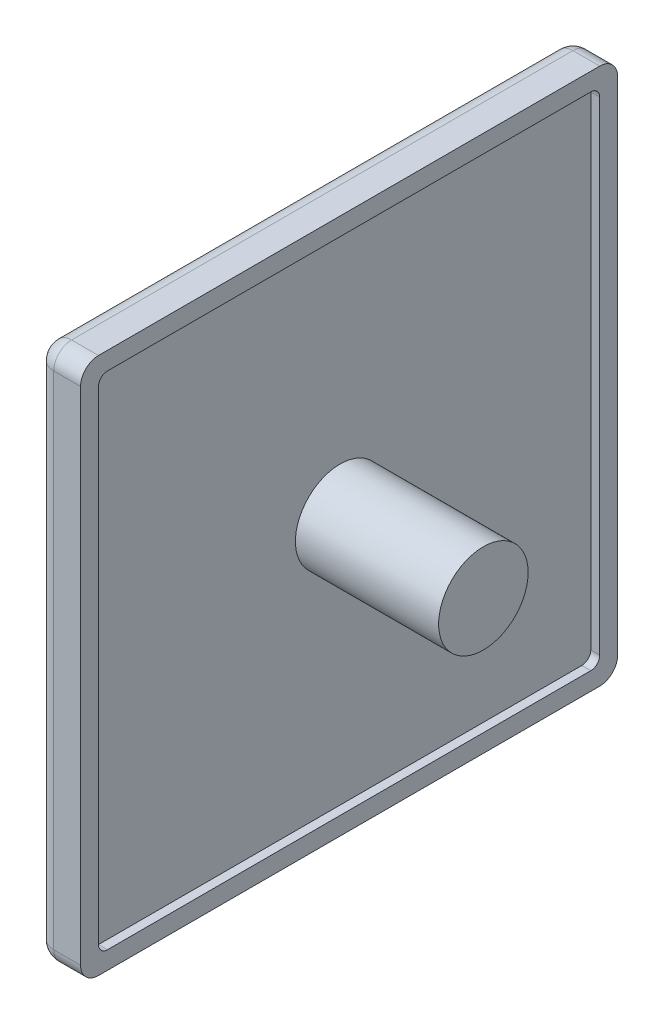
ISO-10303-21;
HEADER;
FILE_DESCRIPTION(('STEP AP214'),'2;1');
FILE_NAME('part.step','',(''),(''),'','','');
FILE_SCHEMA(('AUTOMOTIVE_DESIGN { 1 0 10303 214 1 1 1 1 }'));
ENDSEC;
DATA;
#1=APPLICATION_CONTEXT('core data for automotive mechanical design processes');
#2=APPLICATION_PROTOCOL_DEFINITION('international standard','automotive_design',2000,#1);
#3=PRODUCT_CONTEXT('',#1,'mechanical');
#4=PRODUCT('Part','Part','',(#3));
#5=PRODUCT_RELATED_PRODUCT_CATEGORY('part','',(#4));
#6=PRODUCT_DEFINITION_FORMATION('','',#4);
#7=PRODUCT_DEFINITION_CONTEXT('part definition',#1,'design');
#8=PRODUCT_DEFINITION('design','',#6,#7);
#9=PRODUCT_DEFINITION_SHAPE('','',#8);
#10=(LENGTH_UNIT() NAMED_UNIT(*) SI_UNIT(.MILLI.,.METRE.));
#11=(NAMED_UNIT(*) PLANE_ANGLE_UNIT() SI_UNIT($,.RADIAN.));
#12=(NAMED_UNIT(*) SI_UNIT($,.STERADIAN.) SOLID_ANGLE_UNIT());
#13=UNCERTAINTY_MEASURE_WITH_UNIT(LENGTH_MEASURE(1.E-05),#10,'distance_accuracy_value','');
#14=(GEOMETRIC_REPRESENTATION_CONTEXT(3) GLOBAL_UNCERTAINTY_ASSIGNED_CONTEXT((#13)) GLOBAL_UNIT_ASSIGNED_CONTEXT((#10,
#11,#12)) REPRESENTATION_CONTEXT('',''));
#15=CARTESIAN_POINT('',(0.,0.,0.));
#16=DIRECTION('',(0.,0.,1.));
#17=DIRECTION('',(1.,0.,0.));
#18=AXIS2_PLACEMENT_3D('',#15,#16,#17);
#19=CARTESIAN_POINT('',(2.5,0.,0.));
#20=DIRECTION('',(0.,0.,-1.));
#21=DIRECTION('',(-1.,0.,0.));
#22=AXIS2_PLACEMENT_3D('',#19,#20,#21);
#23=PLANE('',#22);
#24=DIRECTION('',(0.,-1.,0.));
#25=VECTOR('',#24,1.);
#26=CARTESIAN_POINT('',(2.5,0.,0.));
#27=LINE('',#26,#25);
#28=CARTESIAN_POINT('',(2.5,29.,0.));
#29=VERTEX_POINT('',#28);
#30=CARTESIAN_POINT('',(2.5,1.,0.));
#31=VERTEX_POINT('',#30);
#32=EDGE_CURVE('E325',#29,#31,#27,.T.);
#33=ORIENTED_EDGE('',*,*,#32,.F.);
#34=DIRECTION('',(-1.,0.,0.));
#35=VECTOR('',#34,1.);
#36=CARTESIAN_POINT('',(2.5,29.,0.));
#37=LINE('',#36,#35);
#38=CARTESIAN_POINT('',(1.,29.,0.));
#39=VERTEX_POINT('',#38);
#40=EDGE_CURVE('E227',#29,#39,#37,.T.);
#41=ORIENTED_EDGE('',*,*,#40,.T.);
#42=DIRECTION('',(0.,-1.,0.));
#43=VECTOR('',#42,1.);
#44=CARTESIAN_POINT('',(1.,0.,0.));
#45=LINE('',#44,#43);
#46=CARTESIAN_POINT('',(1.,1.,0.));
#47=VERTEX_POINT('',#46);
#48=EDGE_CURVE('E175',#39,#47,#45,.T.);
#49=ORIENTED_EDGE('',*,*,#48,.T.);
#50=DIRECTION('',(-1.,0.,0.));
#51=VECTOR('',#50,1.);
#52=CARTESIAN_POINT('',(2.5,1.,0.));
#53=LINE('',#52,#51);
#54=EDGE_CURVE('E225',#47,#31,#53,.F.);
#55=ORIENTED_EDGE('',*,*,#54,.T.);
#56=EDGE_LOOP('',(#33,#41,#49,#55));
#57=FACE_BOUND('',#56,.T.);
#58=ADVANCED_FACE('F40',(#57),#23,.F.);
#59=CARTESIAN_POINT('',(2.5,0.,0.));
#60=DIRECTION('',(0.,1.,0.));
#61=DIRECTION('',(0.,0.,1.));
#62=AXIS2_PLACEMENT_3D('',#59,#60,#61);
#63=PLANE('',#62);
#64=DIRECTION('',(0.,0.,-1.));
#65=VECTOR('',#64,1.);
#66=CARTESIAN_POINT('',(1.,0.,-30.));
#67=LINE('',#66,#65);
#68=CARTESIAN_POINT('',(1.,0.,-1.));
#69=VERTEX_POINT('',#68);
#70=CARTESIAN_POINT('',(1.,0.,-29.));
#71=VERTEX_POINT('',#70);
#72=EDGE_CURVE('E186',#69,#71,#67,.T.);
#73=ORIENTED_EDGE('',*,*,#72,.T.);
#74=DIRECTION('',(-1.,0.,0.));
#75=VECTOR('',#74,1.);
#76=CARTESIAN_POINT('',(2.5,0.,-29.));
#77=LINE('',#76,#75);
#78=CARTESIAN_POINT('',(2.5,0.,-29.));
#79=VERTEX_POINT('',#78);
#80=EDGE_CURVE('E247',#71,#79,#77,.F.);
#81=ORIENTED_EDGE('',*,*,#80,.T.);
#82=DIRECTION('',(0.,0.,-1.));
#83=VECTOR('',#82,1.);
#84=CARTESIAN_POINT('',(2.5,0.,0.));
#85=LINE('',#84,#83);
#86=CARTESIAN_POINT('',(2.5,0.,-1.));
#87=VERTEX_POINT('',#86);
#88=EDGE_CURVE('E334',#87,#79,#85,.T.);
#89=ORIENTED_EDGE('',*,*,#88,.F.);
#90=DIRECTION('',(-1.,0.,0.));
#91=VECTOR('',#90,1.);
#92=CARTESIAN_POINT('',(2.5,0.,-1.));
#93=LINE('',#92,#91);
#94=EDGE_CURVE('E245',#87,#69,#93,.T.);
#95=ORIENTED_EDGE('',*,*,#94,.T.);
#96=EDGE_LOOP('',(#73,#81,#89,#95));
#97=FACE_BOUND('',#96,.T.);
#98=ADVANCED_FACE('F372',(#97),#63,.F.);
#99=CARTESIAN_POINT('',(2.5,0.,-30.));
#100=DIRECTION('',(0.,0.,1.));
#101=DIRECTION('',(1.,0.,0.));
#102=AXIS2_PLACEMENT_3D('',#99,#100,#101);
#103=PLANE('',#102);
#104=DIRECTION('',(0.,1.,0.));
#105=VECTOR('',#104,1.);
#106=CARTESIAN_POINT('',(1.,30.,-30.));
#107=LINE('',#106,#105);
#108=CARTESIAN_POINT('',(1.,1.,-30.));
#109=VERTEX_POINT('',#108);
#110=CARTESIAN_POINT('',(1.,29.,-30.));
#111=VERTEX_POINT('',#110);
#112=EDGE_CURVE('E204',#109,#111,#107,.T.);
#113=ORIENTED_EDGE('',*,*,#112,.T.);
#114=DIRECTION('',(-1.,0.,0.));
#115=VECTOR('',#114,1.);
#116=CARTESIAN_POINT('',(2.5,29.,-30.));
#117=LINE('',#116,#115);
#118=CARTESIAN_POINT('',(2.5,29.,-30.));
#119=VERTEX_POINT('',#118);
#120=EDGE_CURVE('E243',#111,#119,#117,.F.);
#121=ORIENTED_EDGE('',*,*,#120,.T.);
#122=DIRECTION('',(0.,1.,0.));
#123=VECTOR('',#122,1.);
#124=CARTESIAN_POINT('',(2.5,0.,-30.));
#125=LINE('',#124,#123);
#126=CARTESIAN_POINT('',(2.5,1.,-30.));
#127=VERTEX_POINT('',#126);
#128=EDGE_CURVE('E337',#127,#119,#125,.T.);
#129=ORIENTED_EDGE('',*,*,#128,.F.);
#130=DIRECTION('',(-1.,0.,0.));
#131=VECTOR('',#130,1.);
#132=CARTESIAN_POINT('',(2.5,1.,-30.));
#133=LINE('',#132,#131);
#134=EDGE_CURVE('E241',#127,#109,#133,.T.);
#135=ORIENTED_EDGE('',*,*,#134,.T.);
#136=EDGE_LOOP('',(#113,#121,#129,#135));
#137=FACE_BOUND('',#136,.T.);
#138=ADVANCED_FACE('F360',(#137),#103,.F.);
#139=CARTESIAN_POINT('',(2.5,30.,0.));
#140=DIRECTION('',(0.,-1.,0.));
#141=DIRECTION('',(0.,0.,-1.));
#142=AXIS2_PLACEMENT_3D('',#139,#140,#141);
#143=PLANE('',#142);
#144=DIRECTION('',(0.,0.,1.));
#145=VECTOR('',#144,1.);
#146=CARTESIAN_POINT('',(1.,30.,0.));
#147=LINE('',#146,#145);
#148=CARTESIAN_POINT('',(1.,30.,-29.));
#149=VERTEX_POINT('',#148);
#150=CARTESIAN_POINT('',(1.,30.,-1.));
#151=VERTEX_POINT('',#150);
#152=EDGE_CURVE('E207',#149,#151,#147,.T.);
#153=ORIENTED_EDGE('',*,*,#152,.T.);
#154=DIRECTION('',(-1.,0.,0.));
#155=VECTOR('',#154,1.);
#156=CARTESIAN_POINT('',(2.5,30.,-1.));
#157=LINE('',#156,#155);
#158=CARTESIAN_POINT('',(2.5,30.,-1.));
#159=VERTEX_POINT('',#158);
#160=EDGE_CURVE('E231',#151,#159,#157,.F.);
#161=ORIENTED_EDGE('',*,*,#160,.T.);
#162=DIRECTION('',(0.,0.,1.));
#163=VECTOR('',#162,1.);
#164=CARTESIAN_POINT('',(2.5,30.,0.));
#165=LINE('',#164,#163);
#166=CARTESIAN_POINT('',(2.5,30.,-29.));
#167=VERTEX_POINT('',#166);
#168=EDGE_CURVE('E340',#167,#159,#165,.T.);
#169=ORIENTED_EDGE('',*,*,#168,.F.);
#170=DIRECTION('',(-1.,0.,0.));
#171=VECTOR('',#170,1.);
#172=CARTESIAN_POINT('',(2.5,30.,-29.));
#173=LINE('',#172,#171);
#174=EDGE_CURVE('E229',#167,#149,#173,.T.);
#175=ORIENTED_EDGE('',*,*,#174,.T.);
#176=EDGE_LOOP('',(#153,#161,#169,#175));
#177=FACE_BOUND('',#176,.T.);
#178=ADVANCED_FACE('F391',(#177),#143,.F.);
#179=CARTESIAN_POINT('',(2.5,0.,0.));
#180=DIRECTION('',(-1.,0.,0.));
#181=DIRECTION('',(0.,0.,1.));
#182=AXIS2_PLACEMENT_3D('',#179,#180,#181);
#183=PLANE('',#182);
#184=DIRECTION('',(0.,0.,-1.));
#185=VECTOR('',#184,1.);
#186=CARTESIAN_POINT('',(2.5,1.,-1.));
#187=LINE('',#186,#185);
#188=CARTESIAN_POINT('',(2.5,1.,-1.5));
#189=VERTEX_POINT('',#188);
#190=CARTESIAN_POINT('',(2.5,1.,-28.5));
#191=VERTEX_POINT('',#190);
#192=EDGE_CURVE('E327',#189,#191,#187,.T.);
#193=ORIENTED_EDGE('',*,*,#192,.F.);
#194=CARTESIAN_POINT('',(2.5,1.5,-1.5));
#195=DIRECTION('',(-1.,0.,0.));
#196=DIRECTION('',(0.,0.,1.));
#197=AXIS2_PLACEMENT_3D('',#194,#195,#196);
#198=CIRCLE('',#197,0.5);
#199=CARTESIAN_POINT('',(2.5,1.50000000000001,-1.));
#200=VERTEX_POINT('',#199);
#201=EDGE_CURVE('E11',#189,#200,#198,.T.);
#202=ORIENTED_EDGE('',*,*,#201,.T.);
#203=DIRECTION('',(0.,-1.,0.));
#204=VECTOR('',#203,1.);
#205=CARTESIAN_POINT('',(2.5,29.,-1.));
#206=LINE('',#205,#204);
#207=CARTESIAN_POINT('',(2.5,28.5,-1.));
#208=VERTEX_POINT('',#207);
#209=EDGE_CURVE('E253',#208,#200,#206,.T.);
#210=ORIENTED_EDGE('',*,*,#209,.F.);
#211=CARTESIAN_POINT('',(2.5,28.5,-1.5));
#212=DIRECTION('',(-1.,0.,0.));
#213=DIRECTION('',(0.,0.,1.));
#214=AXIS2_PLACEMENT_3D('',#211,#212,#213);
#215=CIRCLE('',#214,0.5);
#216=CARTESIAN_POINT('',(2.5,29.,-1.5));
#217=VERTEX_POINT('',#216);
#218=EDGE_CURVE('E48',#208,#217,#215,.T.);
#219=ORIENTED_EDGE('',*,*,#218,.T.);
#220=DIRECTION('',(0.,0.,1.));
#221=VECTOR('',#220,1.);
#222=CARTESIAN_POINT('',(2.5,29.,-1.));
#223=LINE('',#222,#221);
#224=CARTESIAN_POINT('',(2.5,29.,-28.5));
#225=VERTEX_POINT('',#224);
#226=EDGE_CURVE('E293',#225,#217,#223,.T.);
#227=ORIENTED_EDGE('',*,*,#226,.F.);
#228=CARTESIAN_POINT('',(2.5,28.5,-28.5));
#229=DIRECTION('',(-1.,0.,0.));
#230=DIRECTION('',(0.,0.,1.));
#231=AXIS2_PLACEMENT_3D('',#228,#229,#230);
#232=CIRCLE('',#231,0.5);
#233=CARTESIAN_POINT('',(2.5,28.5,-29.));
#234=VERTEX_POINT('',#233);
#235=EDGE_CURVE('E288',#225,#234,#232,.T.);
#236=ORIENTED_EDGE('',*,*,#235,.T.);
#237=DIRECTION('',(0.,1.,0.));
#238=VECTOR('',#237,1.);
#239=CARTESIAN_POINT('',(2.5,29.,-29.));
#240=LINE('',#239,#238);
#241=CARTESIAN_POINT('',(2.5,1.50000000000001,-29.));
#242=VERTEX_POINT('',#241);
#243=EDGE_CURVE('E300',#242,#234,#240,.T.);
#244=ORIENTED_EDGE('',*,*,#243,.F.);
#245=CARTESIAN_POINT('',(2.5,1.5,-28.5));
#246=DIRECTION('',(-1.,0.,0.));
#247=DIRECTION('',(0.,0.,1.));
#248=AXIS2_PLACEMENT_3D('',#245,#246,#247);
#249=CIRCLE('',#248,0.5);
#250=EDGE_CURVE('E286',#242,#191,#249,.T.);
#251=ORIENTED_EDGE('',*,*,#250,.T.);
#252=EDGE_LOOP('',(#193,#202,#210,#219,#227,#236,#244,#251));
#253=FACE_BOUND('',#252,.T.);
#254=ORIENTED_EDGE('',*,*,#168,.T.);
#255=CARTESIAN_POINT('',(2.5,29.,-1.));
#256=DIRECTION('',(-1.,0.,0.));
#257=DIRECTION('',(0.,0.,1.));
#258=AXIS2_PLACEMENT_3D('',#255,#256,#257);
#259=CIRCLE('',#258,1.);
#260=EDGE_CURVE('E239',#159,#29,#259,.F.);
#261=ORIENTED_EDGE('',*,*,#260,.T.);
#262=ORIENTED_EDGE('',*,*,#32,.T.);
#263=CARTESIAN_POINT('',(2.5,1.,-1.));
#264=DIRECTION('',(-1.,0.,0.));
#265=DIRECTION('',(0.,0.,1.));
#266=AXIS2_PLACEMENT_3D('',#263,#264,#265);
#267=CIRCLE('',#266,1.);
#268=EDGE_CURVE('E233',#31,#87,#267,.F.);
#269=ORIENTED_EDGE('',*,*,#268,.T.);
#270=ORIENTED_EDGE('',*,*,#88,.T.);
#271=CARTESIAN_POINT('',(2.5,1.,-29.));
#272=DIRECTION('',(-1.,0.,0.));
#273=DIRECTION('',(0.,0.,1.));
#274=AXIS2_PLACEMENT_3D('',#271,#272,#273);
#275=CIRCLE('',#274,1.);
#276=EDGE_CURVE('E235',#79,#127,#275,.F.);
#277=ORIENTED_EDGE('',*,*,#276,.T.);
#278=ORIENTED_EDGE('',*,*,#128,.T.);
#279=CARTESIAN_POINT('',(2.5,29.,-29.));
#280=DIRECTION('',(-1.,0.,0.));
#281=DIRECTION('',(0.,0.,1.));
#282=AXIS2_PLACEMENT_3D('',#279,#280,#281);
#283=CIRCLE('',#282,1.);
#284=EDGE_CURVE('E237',#119,#167,#283,.F.);
#285=ORIENTED_EDGE('',*,*,#284,.T.);
#286=EDGE_LOOP('',(#254,#261,#262,#269,#270,#277,#278,#285));
#287=FACE_BOUND('',#286,.T.);
#288=ADVANCED_FACE('F291',(#253,#287),#183,.F.);
#289=CARTESIAN_POINT('',(0.,0.,0.));
#290=DIRECTION('',(-1.,0.,0.));
#291=DIRECTION('',(0.,0.,1.));
#292=AXIS2_PLACEMENT_3D('',#289,#290,#291);
#293=PLANE('',#292);
#294=DIRECTION('',(0.,1.,0.));
#295=VECTOR('',#294,1.);
#296=CARTESIAN_POINT('',(0.,0.,-29.));
#297=LINE('',#296,#295);
#298=CARTESIAN_POINT('',(0.,29.,-29.));
#299=VERTEX_POINT('',#298);
#300=CARTESIAN_POINT('',(0.,1.,-29.));
#301=VERTEX_POINT('',#300);
#302=EDGE_CURVE('E203',#299,#301,#297,.F.);
#303=ORIENTED_EDGE('',*,*,#302,.T.);
#304=DIRECTION('',(0.,0.,-1.));
#305=VECTOR('',#304,1.);
#306=CARTESIAN_POINT('',(0.,1.,0.));
#307=LINE('',#306,#305);
#308=CARTESIAN_POINT('',(0.,1.,-1.));
#309=VERTEX_POINT('',#308);
#310=EDGE_CURVE('E183',#301,#309,#307,.F.);
#311=ORIENTED_EDGE('',*,*,#310,.T.);
#312=DIRECTION('',(0.,-1.,0.));
#313=VECTOR('',#312,1.);
#314=CARTESIAN_POINT('',(0.,30.,-1.));
#315=LINE('',#314,#313);
#316=CARTESIAN_POINT('',(0.,29.,-1.));
#317=VERTEX_POINT('',#316);
#318=EDGE_CURVE('E192',#309,#317,#315,.F.);
#319=ORIENTED_EDGE('',*,*,#318,.T.);
#320=DIRECTION('',(0.,0.,1.));
#321=VECTOR('',#320,1.);
#322=CARTESIAN_POINT('',(0.,29.,-30.));
#323=LINE('',#322,#321);
#324=EDGE_CURVE('E198',#317,#299,#323,.F.);
#325=ORIENTED_EDGE('',*,*,#324,.T.);
#326=EDGE_LOOP('',(#303,#311,#319,#325));
#327=FACE_BOUND('',#326,.T.);
#328=ADVANCED_FACE('F201',(#327),#293,.T.);
#329=CARTESIAN_POINT('',(2.,29.,-1.));
#330=DIRECTION('',(0.,0.,1.));
#331=DIRECTION('',(0.,-1.,0.));
#332=AXIS2_PLACEMENT_3D('',#329,#330,#331);
#333=PLANE('',#332);
#334=DIRECTION('',(0.,-1.,0.));
#335=VECTOR('',#334,1.);
#336=CARTESIAN_POINT('',(2.,29.,-1.));
#337=LINE('',#336,#335);
#338=CARTESIAN_POINT('',(2.,28.5,-1.));
#339=VERTEX_POINT('',#338);
#340=CARTESIAN_POINT('',(2.,1.50000000000001,-1.));
#341=VERTEX_POINT('',#340);
#342=EDGE_CURVE('E299',#339,#341,#337,.T.);
#343=ORIENTED_EDGE('',*,*,#342,.F.);
#344=DIRECTION('',(1.,0.,0.));
#345=VECTOR('',#344,1.);
#346=CARTESIAN_POINT('',(2.5,28.5,-1.));
#347=LINE('',#346,#345);
#348=EDGE_CURVE('E284',#339,#208,#347,.T.);
#349=ORIENTED_EDGE('',*,*,#348,.T.);
#350=ORIENTED_EDGE('',*,*,#209,.T.);
#351=DIRECTION('',(1.,0.,0.));
#352=VECTOR('',#351,1.);
#353=CARTESIAN_POINT('',(2.,1.5,-1.));
#354=LINE('',#353,#352);
#355=EDGE_CURVE('E282',#200,#341,#354,.F.);
#356=ORIENTED_EDGE('',*,*,#355,.T.);
#357=EDGE_LOOP('',(#343,#349,#350,#356));
#358=FACE_BOUND('',#357,.T.);
#359=ADVANCED_FACE('F312',(#358),#333,.F.);
#360=CARTESIAN_POINT('',(2.,29.,-1.));
#361=DIRECTION('',(0.,1.,0.));
#362=DIRECTION('',(0.,0.,1.));
#363=AXIS2_PLACEMENT_3D('',#360,#361,#362);
#364=PLANE('',#363);
#365=DIRECTION('',(0.,0.,1.));
#366=VECTOR('',#365,1.);
#367=CARTESIAN_POINT('',(2.,29.,-1.));
#368=LINE('',#367,#366);
#369=CARTESIAN_POINT('',(2.,29.,-28.5));
#370=VERTEX_POINT('',#369);
#371=CARTESIAN_POINT('',(2.,29.,-1.5));
#372=VERTEX_POINT('',#371);
#373=EDGE_CURVE('E310',#370,#372,#368,.T.);
#374=ORIENTED_EDGE('',*,*,#373,.F.);
#375=DIRECTION('',(1.,0.,0.));
#376=VECTOR('',#375,1.);
#377=CARTESIAN_POINT('',(2.5,29.,-28.5));
#378=LINE('',#377,#376);
#379=EDGE_CURVE('E279',#370,#225,#378,.T.);
#380=ORIENTED_EDGE('',*,*,#379,.T.);
#381=ORIENTED_EDGE('',*,*,#226,.T.);
#382=DIRECTION('',(1.,0.,0.));
#383=VECTOR('',#382,1.);
#384=CARTESIAN_POINT('',(2.,29.,-1.5));
#385=LINE('',#384,#383);
#386=EDGE_CURVE('E277',#217,#372,#385,.F.);
#387=ORIENTED_EDGE('',*,*,#386,.T.);
#388=EDGE_LOOP('',(#374,#380,#381,#387));
#389=FACE_BOUND('',#388,.T.);
#390=ADVANCED_FACE('F296',(#389),#364,.F.);
#391=CARTESIAN_POINT('',(2.,29.,-29.));
#392=DIRECTION('',(0.,0.,-1.));
#393=DIRECTION('',(0.,1.,0.));
#394=AXIS2_PLACEMENT_3D('',#391,#392,#393);
#395=PLANE('',#394);
#396=DIRECTION('',(0.,1.,0.));
#397=VECTOR('',#396,1.);
#398=CARTESIAN_POINT('',(2.,29.,-29.));
#399=LINE('',#398,#397);
#400=CARTESIAN_POINT('',(2.,1.50000000000001,-29.));
#401=VERTEX_POINT('',#400);
#402=CARTESIAN_POINT('',(2.,28.5,-29.));
#403=VERTEX_POINT('',#402);
#404=EDGE_CURVE('E316',#401,#403,#399,.T.);
#405=ORIENTED_EDGE('',*,*,#404,.F.);
#406=DIRECTION('',(1.,0.,0.));
#407=VECTOR('',#406,1.);
#408=CARTESIAN_POINT('',(2.5,1.5,-29.));
#409=LINE('',#408,#407);
#410=EDGE_CURVE('E261',#401,#242,#409,.T.);
#411=ORIENTED_EDGE('',*,*,#410,.T.);
#412=ORIENTED_EDGE('',*,*,#243,.T.);
#413=DIRECTION('',(1.,0.,0.));
#414=VECTOR('',#413,1.);
#415=CARTESIAN_POINT('',(2.,28.5,-29.));
#416=LINE('',#415,#414);
#417=EDGE_CURVE('E249',#234,#403,#416,.F.);
#418=ORIENTED_EDGE('',*,*,#417,.T.);
#419=EDGE_LOOP('',(#405,#411,#412,#418));
#420=FACE_BOUND('',#419,.T.);
#421=ADVANCED_FACE('F461',(#420),#395,.F.);
#422=CARTESIAN_POINT('',(2.,1.,-1.));
#423=DIRECTION('',(0.,-1.,0.));
#424=DIRECTION('',(0.,0.,-1.));
#425=AXIS2_PLACEMENT_3D('',#422,#423,#424);
#426=PLANE('',#425);
#427=ORIENTED_EDGE('',*,*,#192,.T.);
#428=DIRECTION('',(1.,0.,0.));
#429=VECTOR('',#428,1.);
#430=CARTESIAN_POINT('',(2.,1.,-28.5));
#431=LINE('',#430,#429);
#432=CARTESIAN_POINT('',(2.,1.,-28.5));
#433=VERTEX_POINT('',#432);
#434=EDGE_CURVE('E267',#191,#433,#431,.F.);
#435=ORIENTED_EDGE('',*,*,#434,.T.);
#436=DIRECTION('',(0.,0.,-1.));
#437=VECTOR('',#436,1.);
#438=CARTESIAN_POINT('',(2.,1.,-1.));
#439=LINE('',#438,#437);
#440=CARTESIAN_POINT('',(2.,1.,-1.5));
#441=VERTEX_POINT('',#440);
#442=EDGE_CURVE('E314',#441,#433,#439,.T.);
#443=ORIENTED_EDGE('',*,*,#442,.F.);
#444=DIRECTION('',(1.,0.,0.));
#445=VECTOR('',#444,1.);
#446=CARTESIAN_POINT('',(2.5,1.,-1.5));
#447=LINE('',#446,#445);
#448=EDGE_CURVE('E264',#441,#189,#447,.T.);
#449=ORIENTED_EDGE('',*,*,#448,.T.);
#450=EDGE_LOOP('',(#427,#435,#443,#449));
#451=FACE_BOUND('',#450,.T.);
#452=ADVANCED_FACE('F455',(#451),#426,.F.);
#453=CARTESIAN_POINT('',(2.,0.,0.));
#454=DIRECTION('',(1.,0.,0.));
#455=DIRECTION('',(0.,0.,-1.));
#456=AXIS2_PLACEMENT_3D('',#453,#454,#455);
#457=PLANE('',#456);
#458=CARTESIAN_POINT('',(2.,15.,-15.));
#459=DIRECTION('',(1.,0.,0.));
#460=DIRECTION('',(0.,0.,-1.));
#461=AXIS2_PLACEMENT_3D('',#458,#459,#460);
#462=CIRCLE('',#461,2.5);
#463=CARTESIAN_POINT('',(2.,15.,-17.5));
#464=VERTEX_POINT('',#463);
#465=EDGE_CURVE('E319',#464,#464,#462,.T.);
#466=ORIENTED_EDGE('',*,*,#465,.F.);
#467=EDGE_LOOP('',(#466));
#468=FACE_BOUND('',#467,.T.);
#469=ORIENTED_EDGE('',*,*,#442,.T.);
#470=CARTESIAN_POINT('',(2.,1.5,-28.5));
#471=DIRECTION('',(1.,0.,0.));
#472=DIRECTION('',(0.,0.,-1.));
#473=AXIS2_PLACEMENT_3D('',#470,#471,#472);
#474=CIRCLE('',#473,0.5);
#475=EDGE_CURVE('E275',#433,#401,#474,.T.);
#476=ORIENTED_EDGE('',*,*,#475,.T.);
#477=ORIENTED_EDGE('',*,*,#404,.T.);
#478=CARTESIAN_POINT('',(2.,28.5,-28.5));
#479=DIRECTION('',(1.,0.,0.));
#480=DIRECTION('',(0.,0.,-1.));
#481=AXIS2_PLACEMENT_3D('',#478,#479,#480);
#482=CIRCLE('',#481,0.5);
#483=EDGE_CURVE('E273',#403,#370,#482,.T.);
#484=ORIENTED_EDGE('',*,*,#483,.T.);
#485=ORIENTED_EDGE('',*,*,#373,.T.);
#486=CARTESIAN_POINT('',(2.,28.5,-1.5));
#487=DIRECTION('',(1.,0.,0.));
#488=DIRECTION('',(0.,0.,-1.));
#489=AXIS2_PLACEMENT_3D('',#486,#487,#488);
#490=CIRCLE('',#489,0.5);
#491=EDGE_CURVE('E271',#372,#339,#490,.T.);
#492=ORIENTED_EDGE('',*,*,#491,.T.);
#493=ORIENTED_EDGE('',*,*,#342,.T.);
#494=CARTESIAN_POINT('',(2.,1.5,-1.5));
#495=DIRECTION('',(1.,0.,0.));
#496=DIRECTION('',(0.,0.,-1.));
#497=AXIS2_PLACEMENT_3D('',#494,#495,#496);
#498=CIRCLE('',#497,0.5);
#499=EDGE_CURVE('E269',#341,#441,#498,.T.);
#500=ORIENTED_EDGE('',*,*,#499,.T.);
#501=EDGE_LOOP('',(#469,#476,#477,#484,#485,#492,#493,#500));
#502=FACE_BOUND('',#501,.T.);
#503=ADVANCED_FACE('F308',(#468,#502),#457,.T.);
#504=CARTESIAN_POINT('',(1.,29.,0.));
#505=DIRECTION('',(0.,0.,-1.));
#506=DIRECTION('',(-1.,0.,0.));
#507=AXIS2_PLACEMENT_3D('',#504,#505,#506);
#508=CYLINDRICAL_SURFACE('',#507,1.);
#509=ORIENTED_EDGE('',*,*,#324,.F.);
#510=CARTESIAN_POINT('',(1.,29.,-1.));
#511=DIRECTION('',(0.,0.,-1.));
#512=DIRECTION('',(-1.,0.,0.));
#513=AXIS2_PLACEMENT_3D('',#510,#511,#512);
#514=CIRCLE('',#513,1.);
#515=EDGE_CURVE('E218',#317,#151,#514,.T.);
#516=ORIENTED_EDGE('',*,*,#515,.T.);
#517=ORIENTED_EDGE('',*,*,#152,.F.);
#518=CARTESIAN_POINT('',(1.,29.,-29.));
#519=DIRECTION('',(0.,0.,-1.));
#520=DIRECTION('',(-1.,0.,0.));
#521=AXIS2_PLACEMENT_3D('',#518,#519,#520);
#522=CIRCLE('',#521,1.);
#523=EDGE_CURVE('E216',#149,#299,#522,.F.);
#524=ORIENTED_EDGE('',*,*,#523,.T.);
#525=EDGE_LOOP('',(#509,#516,#517,#524));
#526=FACE_BOUND('',#525,.T.);
#527=ADVANCED_FACE('F389',(#526),#508,.T.);
#528=CARTESIAN_POINT('',(1.,0.,-1.));
#529=DIRECTION('',(0.,1.,0.));
#530=DIRECTION('',(0.,0.,1.));
#531=AXIS2_PLACEMENT_3D('',#528,#529,#530);
#532=CYLINDRICAL_SURFACE('',#531,1.);
#533=ORIENTED_EDGE('',*,*,#48,.F.);
#534=CARTESIAN_POINT('',(1.,29.,-1.));
#535=DIRECTION('',(0.,1.,0.));
#536=DIRECTION('',(0.,0.,1.));
#537=AXIS2_PLACEMENT_3D('',#534,#535,#536);
#538=CIRCLE('',#537,1.);
#539=EDGE_CURVE('E174',#39,#317,#538,.F.);
#540=ORIENTED_EDGE('',*,*,#539,.T.);
#541=ORIENTED_EDGE('',*,*,#318,.F.);
#542=CARTESIAN_POINT('',(1.,1.,-1.));
#543=DIRECTION('',(0.,1.,0.));
#544=DIRECTION('',(0.,0.,1.));
#545=AXIS2_PLACEMENT_3D('',#542,#543,#544);
#546=CIRCLE('',#545,1.);
#547=EDGE_CURVE('E164',#309,#47,#546,.T.);
#548=ORIENTED_EDGE('',*,*,#547,.T.);
#549=EDGE_LOOP('',(#533,#540,#541,#548));
#550=FACE_BOUND('',#549,.T.);
#551=ADVANCED_FACE('F193',(#550),#532,.T.);
#552=CARTESIAN_POINT('',(1.,0.,-29.));
#553=DIRECTION('',(0.,-1.,0.));
#554=DIRECTION('',(0.,0.,-1.));
#555=AXIS2_PLACEMENT_3D('',#552,#553,#554);
#556=CYLINDRICAL_SURFACE('',#555,1.);
#557=ORIENTED_EDGE('',*,*,#302,.F.);
#558=CARTESIAN_POINT('',(1.,29.,-29.));
#559=DIRECTION('',(0.,-1.,0.));
#560=DIRECTION('',(0.,0.,-1.));
#561=AXIS2_PLACEMENT_3D('',#558,#559,#560);
#562=CIRCLE('',#561,1.);
#563=EDGE_CURVE('E188',#299,#111,#562,.T.);
#564=ORIENTED_EDGE('',*,*,#563,.T.);
#565=ORIENTED_EDGE('',*,*,#112,.F.);
#566=CARTESIAN_POINT('',(1.,1.,-29.));
#567=DIRECTION('',(0.,-1.,0.));
#568=DIRECTION('',(0.,0.,-1.));
#569=AXIS2_PLACEMENT_3D('',#566,#567,#568);
#570=CIRCLE('',#569,1.);
#571=EDGE_CURVE('E220',#109,#301,#570,.F.);
#572=ORIENTED_EDGE('',*,*,#571,.T.);
#573=EDGE_LOOP('',(#557,#564,#565,#572));
#574=FACE_BOUND('',#573,.T.);
#575=ADVANCED_FACE('F346',(#574),#556,.T.);
#576=CARTESIAN_POINT('',(1.,1.,0.));
#577=DIRECTION('',(0.,0.,1.));
#578=DIRECTION('',(1.,0.,0.));
#579=AXIS2_PLACEMENT_3D('',#576,#577,#578);
#580=CYLINDRICAL_SURFACE('',#579,1.);
#581=ORIENTED_EDGE('',*,*,#310,.F.);
#582=CARTESIAN_POINT('',(1.,1.,-29.));
#583=DIRECTION('',(0.,0.,1.));
#584=DIRECTION('',(1.,0.,0.));
#585=AXIS2_PLACEMENT_3D('',#582,#583,#584);
#586=CIRCLE('',#585,1.);
#587=EDGE_CURVE('E187',#301,#71,#586,.T.);
#588=ORIENTED_EDGE('',*,*,#587,.T.);
#589=ORIENTED_EDGE('',*,*,#72,.F.);
#590=CARTESIAN_POINT('',(1.,1.,-1.));
#591=DIRECTION('',(0.,0.,1.));
#592=DIRECTION('',(1.,0.,0.));
#593=AXIS2_PLACEMENT_3D('',#590,#591,#592);
#594=CIRCLE('',#593,1.);
#595=EDGE_CURVE('E167',#69,#309,#594,.F.);
#596=ORIENTED_EDGE('',*,*,#595,.T.);
#597=EDGE_LOOP('',(#581,#588,#589,#596));
#598=FACE_BOUND('',#597,.T.);
#599=ADVANCED_FACE('F180',(#598),#580,.T.);
#600=CARTESIAN_POINT('',(2.5,29.,-1.));
#601=DIRECTION('',(-1.,0.,0.));
#602=DIRECTION('',(0.,0.,1.));
#603=AXIS2_PLACEMENT_3D('',#600,#601,#602);
#604=CYLINDRICAL_SURFACE('',#603,1.);
#605=ORIENTED_EDGE('',*,*,#260,.F.);
#606=ORIENTED_EDGE('',*,*,#160,.F.);
#607=CARTESIAN_POINT('',(1.,29.,-1.));
#608=DIRECTION('',(-1.,0.,0.));
#609=DIRECTION('',(0.,0.,1.));
#610=AXIS2_PLACEMENT_3D('',#607,#608,#609);
#611=CIRCLE('',#610,1.);
#612=EDGE_CURVE('E250',#39,#151,#611,.T.);
#613=ORIENTED_EDGE('',*,*,#612,.F.);
#614=ORIENTED_EDGE('',*,*,#40,.F.);
#615=EDGE_LOOP('',(#605,#606,#613,#614));
#616=FACE_BOUND('',#615,.T.);
#617=ADVANCED_FACE('F384',(#616),#604,.T.);
#618=CARTESIAN_POINT('',(1.,29.,-1.));
#619=DIRECTION('',(0.,0.,1.));
#620=DIRECTION('',(1.,0.,0.));
#621=AXIS2_PLACEMENT_3D('',#618,#619,#620);
#622=SPHERICAL_SURFACE('',#621,1.);
#623=ORIENTED_EDGE('',*,*,#612,.T.);
#624=ORIENTED_EDGE('',*,*,#515,.F.);
#625=ORIENTED_EDGE('',*,*,#539,.F.);
#626=EDGE_LOOP('',(#623,#624,#625));
#627=FACE_BOUND('',#626,.T.);
#628=ADVANCED_FACE('F387',(#627),#622,.T.);
#629=CARTESIAN_POINT('',(2.5,29.,-29.));
#630=DIRECTION('',(-1.,0.,0.));
#631=DIRECTION('',(0.,0.,1.));
#632=AXIS2_PLACEMENT_3D('',#629,#630,#631);
#633=CYLINDRICAL_SURFACE('',#632,1.);
#634=ORIENTED_EDGE('',*,*,#284,.F.);
#635=ORIENTED_EDGE('',*,*,#120,.F.);
#636=CARTESIAN_POINT('',(1.,29.,-29.));
#637=DIRECTION('',(-1.,0.,0.));
#638=DIRECTION('',(0.,0.,1.));
#639=AXIS2_PLACEMENT_3D('',#636,#637,#638);
#640=CIRCLE('',#639,1.);
#641=EDGE_CURVE('E254',#149,#111,#640,.T.);
#642=ORIENTED_EDGE('',*,*,#641,.F.);
#643=ORIENTED_EDGE('',*,*,#174,.F.);
#644=EDGE_LOOP('',(#634,#635,#642,#643));
#645=FACE_BOUND('',#644,.T.);
#646=ADVANCED_FACE('F357',(#645),#633,.T.);
#647=CARTESIAN_POINT('',(1.,29.,-29.));
#648=DIRECTION('',(0.,0.,1.));
#649=DIRECTION('',(1.,0.,0.));
#650=AXIS2_PLACEMENT_3D('',#647,#648,#649);
#651=SPHERICAL_SURFACE('',#650,1.);
#652=ORIENTED_EDGE('',*,*,#563,.F.);
#653=ORIENTED_EDGE('',*,*,#523,.F.);
#654=ORIENTED_EDGE('',*,*,#641,.T.);
#655=EDGE_LOOP('',(#652,#653,#654));
#656=FACE_BOUND('',#655,.T.);
#657=ADVANCED_FACE('F351',(#656),#651,.T.);
#658=CARTESIAN_POINT('',(2.5,1.,-29.));
#659=DIRECTION('',(-1.,0.,0.));
#660=DIRECTION('',(0.,0.,1.));
#661=AXIS2_PLACEMENT_3D('',#658,#659,#660);
#662=CYLINDRICAL_SURFACE('',#661,1.);
#663=ORIENTED_EDGE('',*,*,#276,.F.);
#664=ORIENTED_EDGE('',*,*,#80,.F.);
#665=CARTESIAN_POINT('',(1.,1.,-29.));
#666=DIRECTION('',(-1.,0.,0.));
#667=DIRECTION('',(0.,0.,1.));
#668=AXIS2_PLACEMENT_3D('',#665,#666,#667);
#669=CIRCLE('',#668,1.);
#670=EDGE_CURVE('E256',#109,#71,#669,.T.);
#671=ORIENTED_EDGE('',*,*,#670,.F.);
#672=ORIENTED_EDGE('',*,*,#134,.F.);
#673=EDGE_LOOP('',(#663,#664,#671,#672));
#674=FACE_BOUND('',#673,.T.);
#675=ADVANCED_FACE('F367',(#674),#662,.T.);
#676=CARTESIAN_POINT('',(1.,1.,-29.));
#677=DIRECTION('',(0.,0.,1.));
#678=DIRECTION('',(1.,0.,0.));
#679=AXIS2_PLACEMENT_3D('',#676,#677,#678);
#680=SPHERICAL_SURFACE('',#679,1.);
#681=ORIENTED_EDGE('',*,*,#587,.F.);
#682=ORIENTED_EDGE('',*,*,#571,.F.);
#683=ORIENTED_EDGE('',*,*,#670,.T.);
#684=EDGE_LOOP('',(#681,#682,#683));
#685=FACE_BOUND('',#684,.T.);
#686=ADVANCED_FACE('F370',(#685),#680,.T.);
#687=CARTESIAN_POINT('',(2.5,1.,-1.));
#688=DIRECTION('',(-1.,0.,0.));
#689=DIRECTION('',(0.,0.,1.));
#690=AXIS2_PLACEMENT_3D('',#687,#688,#689);
#691=CYLINDRICAL_SURFACE('',#690,1.);
#692=ORIENTED_EDGE('',*,*,#268,.F.);
#693=ORIENTED_EDGE('',*,*,#54,.F.);
#694=CARTESIAN_POINT('',(1.,1.,-1.));
#695=DIRECTION('',(-1.,0.,0.));
#696=DIRECTION('',(0.,0.,1.));
#697=AXIS2_PLACEMENT_3D('',#694,#695,#696);
#698=CIRCLE('',#697,1.);
#699=EDGE_CURVE('E169',#69,#47,#698,.T.);
#700=ORIENTED_EDGE('',*,*,#699,.F.);
#701=ORIENTED_EDGE('',*,*,#94,.F.);
#702=EDGE_LOOP('',(#692,#693,#700,#701));
#703=FACE_BOUND('',#702,.T.);
#704=ADVANCED_FACE('F376',(#703),#691,.T.);
#705=CARTESIAN_POINT('',(1.,1.,-1.));
#706=DIRECTION('',(0.,0.,1.));
#707=DIRECTION('',(1.,0.,0.));
#708=AXIS2_PLACEMENT_3D('',#705,#706,#707);
#709=SPHERICAL_SURFACE('',#708,1.);
#710=ORIENTED_EDGE('',*,*,#699,.T.);
#711=ORIENTED_EDGE('',*,*,#547,.F.);
#712=ORIENTED_EDGE('',*,*,#595,.F.);
#713=EDGE_LOOP('',(#710,#711,#712));
#714=FACE_BOUND('',#713,.T.);
#715=ADVANCED_FACE('F166',(#714),#709,.T.);
#716=CARTESIAN_POINT('',(2.,1.5,-28.5));
#717=DIRECTION('',(-1.,0.,0.));
#718=DIRECTION('',(0.,0.,1.));
#719=AXIS2_PLACEMENT_3D('',#716,#717,#718);
#720=CYLINDRICAL_SURFACE('',#719,0.5);
#721=ORIENTED_EDGE('',*,*,#475,.F.);
#722=ORIENTED_EDGE('',*,*,#434,.F.);
#723=ORIENTED_EDGE('',*,*,#250,.F.);
#724=ORIENTED_EDGE('',*,*,#410,.F.);
#725=EDGE_LOOP('',(#721,#722,#723,#724));
#726=FACE_BOUND('',#725,.T.);
#727=ADVANCED_FACE('F430',(#726),#720,.F.);
#728=CARTESIAN_POINT('',(2.,28.5,-28.5));
#729=DIRECTION('',(-1.,0.,0.));
#730=DIRECTION('',(0.,0.,1.));
#731=AXIS2_PLACEMENT_3D('',#728,#729,#730);
#732=CYLINDRICAL_SURFACE('',#731,0.5);
#733=ORIENTED_EDGE('',*,*,#483,.F.);
#734=ORIENTED_EDGE('',*,*,#417,.F.);
#735=ORIENTED_EDGE('',*,*,#235,.F.);
#736=ORIENTED_EDGE('',*,*,#379,.F.);
#737=EDGE_LOOP('',(#733,#734,#735,#736));
#738=FACE_BOUND('',#737,.T.);
#739=ADVANCED_FACE('F435',(#738),#732,.F.);
#740=CARTESIAN_POINT('',(2.,28.5,-1.5));
#741=DIRECTION('',(-1.,0.,0.));
#742=DIRECTION('',(0.,0.,1.));
#743=AXIS2_PLACEMENT_3D('',#740,#741,#742);
#744=CYLINDRICAL_SURFACE('',#743,0.5);
#745=ORIENTED_EDGE('',*,*,#491,.F.);
#746=ORIENTED_EDGE('',*,*,#386,.F.);
#747=ORIENTED_EDGE('',*,*,#218,.F.);
#748=ORIENTED_EDGE('',*,*,#348,.F.);
#749=EDGE_LOOP('',(#745,#746,#747,#748));
#750=FACE_BOUND('',#749,.T.);
#751=ADVANCED_FACE('F303',(#750),#744,.F.);
#752=CARTESIAN_POINT('',(2.,1.5,-1.5));
#753=DIRECTION('',(-1.,0.,0.));
#754=DIRECTION('',(0.,0.,1.));
#755=AXIS2_PLACEMENT_3D('',#752,#753,#754);
#756=CYLINDRICAL_SURFACE('',#755,0.5);
#757=ORIENTED_EDGE('',*,*,#499,.F.);
#758=ORIENTED_EDGE('',*,*,#355,.F.);
#759=ORIENTED_EDGE('',*,*,#201,.F.);
#760=ORIENTED_EDGE('',*,*,#448,.F.);
#761=EDGE_LOOP('',(#757,#758,#759,#760));
#762=FACE_BOUND('',#761,.T.);
#763=ADVANCED_FACE('F42',(#762),#756,.F.);
#764=CARTESIAN_POINT('',(10.,15.,-15.));
#765=DIRECTION('',(-1.,0.,0.));
#766=DIRECTION('',(0.,0.,1.));
#767=AXIS2_PLACEMENT_3D('',#764,#765,#766);
#768=CYLINDRICAL_SURFACE('',#767,2.5);
#769=CARTESIAN_POINT('',(10.,15.,-15.));
#770=DIRECTION('',(1.,0.,0.));
#771=DIRECTION('',(0.,0.,-1.));
#772=AXIS2_PLACEMENT_3D('',#769,#770,#771);
#773=CIRCLE('',#772,2.5);
#774=CARTESIAN_POINT('',(10.,15.,-17.5));
#775=VERTEX_POINT('',#774);
#776=EDGE_CURVE('E259',#775,#775,#773,.T.);
#777=ORIENTED_EDGE('',*,*,#776,.F.);
#778=EDGE_LOOP('',(#777));
#779=FACE_BOUND('',#778,.T.);
#780=ORIENTED_EDGE('',*,*,#465,.T.);
#781=EDGE_LOOP('',(#780));
#782=FACE_BOUND('',#781,.T.);
#783=ADVANCED_FACE('F443',(#779,#782),#768,.T.);
#784=CARTESIAN_POINT('',(10.,15.,-15.));
#785=DIRECTION('',(1.,0.,0.));
#786=DIRECTION('',(0.,0.,-1.));
#787=AXIS2_PLACEMENT_3D('',#784,#785,#786);
#788=PLANE('',#787);
#789=ORIENTED_EDGE('',*,*,#776,.T.);
#790=EDGE_LOOP('',(#789));
#791=FACE_BOUND('',#790,.T.);
#792=ADVANCED_FACE('F448',(#791),#788,.T.);
#793=CLOSED_SHELL('',(#58,#98,#138,#178,#288,#328,#359,#390,#421,#452,#503,#527,#551,#575,#599,
#617,#628,#646,#657,#675,#686,#704,#715,#727,#739,#751,#763,#783,#792));
#794=MANIFOLD_SOLID_BREP('B2',#793);
#795=ADVANCED_BREP_SHAPE_REPRESENTATION('',(#18,#794),#14);
#796=SHAPE_DEFINITION_REPRESENTATION(#9,#795);
ENDSEC;
END-ISO-10303-21;
